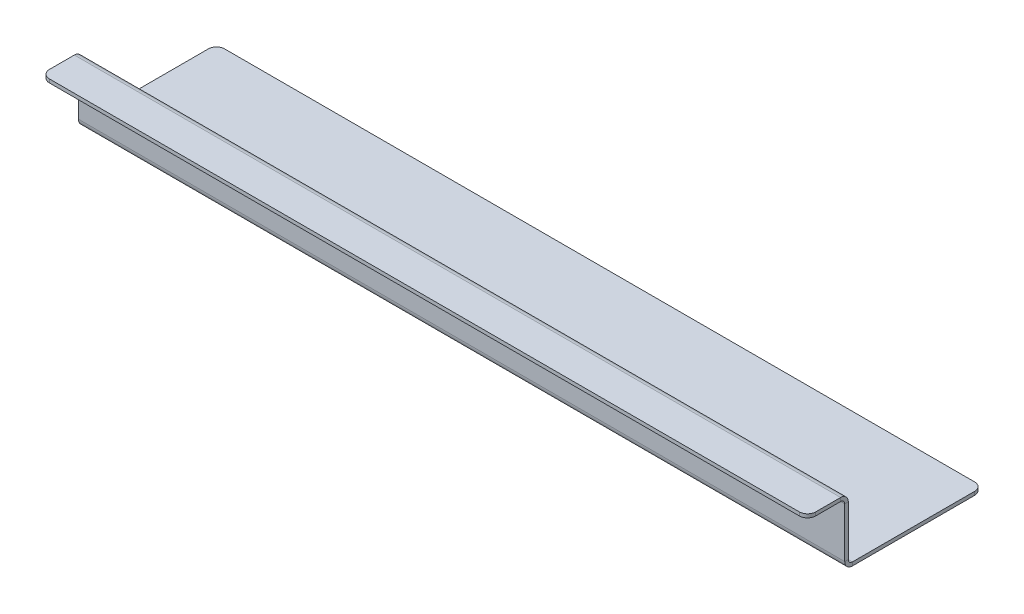
ISO-10303-21;
HEADER;
FILE_DESCRIPTION(('STEP AP214'),'2;1');
FILE_NAME('part.step','',(''),(''),'','','');
FILE_SCHEMA(('AUTOMOTIVE_DESIGN { 1 0 10303 214 1 1 1 1 }'));
ENDSEC;
DATA;
#1=APPLICATION_CONTEXT('core data for automotive mechanical design processes');
#2=APPLICATION_PROTOCOL_DEFINITION('international standard','automotive_design',2000,#1);
#3=PRODUCT_CONTEXT('',#1,'mechanical');
#4=PRODUCT('Part','Part','',(#3));
#5=PRODUCT_RELATED_PRODUCT_CATEGORY('part','',(#4));
#6=PRODUCT_DEFINITION_FORMATION('','',#4);
#7=PRODUCT_DEFINITION_CONTEXT('part definition',#1,'design');
#8=PRODUCT_DEFINITION('design','',#6,#7);
#9=PRODUCT_DEFINITION_SHAPE('','',#8);
#10=(LENGTH_UNIT() NAMED_UNIT(*) SI_UNIT(.MILLI.,.METRE.));
#11=(NAMED_UNIT(*) PLANE_ANGLE_UNIT() SI_UNIT($,.RADIAN.));
#12=(NAMED_UNIT(*) SI_UNIT($,.STERADIAN.) SOLID_ANGLE_UNIT());
#13=UNCERTAINTY_MEASURE_WITH_UNIT(LENGTH_MEASURE(1.E-05),#10,'distance_accuracy_value','');
#14=(GEOMETRIC_REPRESENTATION_CONTEXT(3) GLOBAL_UNCERTAINTY_ASSIGNED_CONTEXT((#13)) GLOBAL_UNIT_ASSIGNED_CONTEXT((#10,
#11,#12)) REPRESENTATION_CONTEXT('',''));
#15=CARTESIAN_POINT('',(0.,0.,0.));
#16=DIRECTION('',(0.,0.,1.));
#17=DIRECTION('',(1.,0.,0.));
#18=AXIS2_PLACEMENT_3D('',#15,#16,#17);
#19=CARTESIAN_POINT('',(596.9,-50.8,-31.7500000000002));
#20=DIRECTION('',(-1.,0.,0.));
#21=DIRECTION('',(0.,0.,1.));
#22=AXIS2_PLACEMENT_3D('',#19,#20,#21);
#23=PLANE('',#22);
#24=DIRECTION('',(0.,0.,1.));
#25=VECTOR('',#24,1.);
#26=CARTESIAN_POINT('',(596.9,-44.87164,-31.7500000000001));
#27=LINE('',#26,#25);
#28=CARTESIAN_POINT('',(596.9,-44.87164,-31.7500000000001));
#29=VERTEX_POINT('',#28);
#30=CARTESIAN_POINT('',(596.9,-44.87164,-28.9966400000001));
#31=VERTEX_POINT('',#30);
#32=EDGE_CURVE('E252',#29,#31,#27,.T.);
#33=ORIENTED_EDGE('',*,*,#32,.F.);
#34=DIRECTION('',(0.,-1.,0.));
#35=VECTOR('',#34,1.);
#36=CARTESIAN_POINT('',(596.9,1.19661315799875E-13,-31.75));
#37=LINE('',#36,#35);
#38=CARTESIAN_POINT('',(596.9,-5.92835999999999,-31.75));
#39=VERTEX_POINT('',#38);
#40=EDGE_CURVE('E260',#39,#29,#37,.T.);
#41=ORIENTED_EDGE('',*,*,#40,.F.);
#42=DIRECTION('',(0.,0.,1.));
#43=VECTOR('',#42,1.);
#44=CARTESIAN_POINT('',(596.9,-5.92836000000001,-28.99664));
#45=LINE('',#44,#43);
#46=CARTESIAN_POINT('',(596.9,-5.92836000000005,-28.99664));
#47=VERTEX_POINT('',#46);
#48=EDGE_CURVE('E271',#47,#39,#45,.F.);
#49=ORIENTED_EDGE('',*,*,#48,.F.);
#50=DIRECTION('',(0.,1.,0.));
#51=VECTOR('',#50,1.);
#52=CARTESIAN_POINT('',(596.9,-50.8,-28.9966400000002));
#53=LINE('',#52,#51);
#54=EDGE_CURVE('E265',#47,#31,#53,.F.);
#55=ORIENTED_EDGE('',*,*,#54,.T.);
#56=EDGE_LOOP('',(#33,#41,#49,#55));
#57=FACE_BOUND('',#56,.T.);
#58=ADVANCED_FACE('F83',(#57),#23,.F.);
#59=CARTESIAN_POINT('',(0.,-2.75335999999999,-31.75));
#60=DIRECTION('',(1.,0.,0.));
#61=DIRECTION('',(0.,0.,-1.));
#62=AXIS2_PLACEMENT_3D('',#59,#60,#61);
#63=PLANE('',#62);
#64=DIRECTION('',(0.,0.,1.));
#65=VECTOR('',#64,1.);
#66=CARTESIAN_POINT('',(0.,-44.87164,-31.7500000000001));
#67=LINE('',#66,#65);
#68=CARTESIAN_POINT('',(0.,-44.87164,-31.7500000000001));
#69=VERTEX_POINT('',#68);
#70=CARTESIAN_POINT('',(0.,-44.87164,-28.9966400000001));
#71=VERTEX_POINT('',#70);
#72=EDGE_CURVE('E245',#69,#71,#67,.T.);
#73=ORIENTED_EDGE('',*,*,#72,.T.);
#74=DIRECTION('',(0.,-1.,0.));
#75=VECTOR('',#74,1.);
#76=CARTESIAN_POINT('',(0.,-2.75336,-28.99664));
#77=LINE('',#76,#75);
#78=CARTESIAN_POINT('',(0.,-5.92835999999997,-28.99664));
#79=VERTEX_POINT('',#78);
#80=EDGE_CURVE('E263',#71,#79,#77,.F.);
#81=ORIENTED_EDGE('',*,*,#80,.T.);
#82=DIRECTION('',(0.,0.,1.));
#83=VECTOR('',#82,1.);
#84=CARTESIAN_POINT('',(0.,-5.92835999999997,-31.75));
#85=LINE('',#84,#83);
#86=CARTESIAN_POINT('',(0.,-5.92835999999996,-31.75));
#87=VERTEX_POINT('',#86);
#88=EDGE_CURVE('E255',#79,#87,#85,.F.);
#89=ORIENTED_EDGE('',*,*,#88,.T.);
#90=DIRECTION('',(0.,1.,0.));
#91=VECTOR('',#90,1.);
#92=CARTESIAN_POINT('',(0.,1.19661315799875E-13,-31.75));
#93=LINE('',#92,#91);
#94=EDGE_CURVE('E257',#69,#87,#93,.T.);
#95=ORIENTED_EDGE('',*,*,#94,.F.);
#96=EDGE_LOOP('',(#73,#81,#89,#95));
#97=FACE_BOUND('',#96,.T.);
#98=ADVANCED_FACE('F385',(#97),#63,.F.);
#99=CARTESIAN_POINT('',(0.,1.19661315799875E-13,-31.75));
#100=DIRECTION('',(0.,0.,1.));
#101=DIRECTION('',(0.,-1.,0.));
#102=AXIS2_PLACEMENT_3D('',#99,#100,#101);
#103=PLANE('',#102);
#104=DIRECTION('',(-1.,0.,0.));
#105=VECTOR('',#104,1.);
#106=CARTESIAN_POINT('',(0.,-44.87164,-31.7500000000001));
#107=LINE('',#106,#105);
#108=EDGE_CURVE('E249',#69,#29,#107,.F.);
#109=ORIENTED_EDGE('',*,*,#108,.F.);
#110=ORIENTED_EDGE('',*,*,#94,.T.);
#111=DIRECTION('',(1.,0.,0.));
#112=VECTOR('',#111,1.);
#113=CARTESIAN_POINT('',(0.,-5.92835999999997,-31.75));
#114=LINE('',#113,#112);
#115=EDGE_CURVE('E268',#39,#87,#114,.F.);
#116=ORIENTED_EDGE('',*,*,#115,.F.);
#117=ORIENTED_EDGE('',*,*,#40,.T.);
#118=EDGE_LOOP('',(#109,#110,#116,#117));
#119=FACE_BOUND('',#118,.T.);
#120=ADVANCED_FACE('F374',(#119),#103,.F.);
#121=CARTESIAN_POINT('',(0.,1.10048010740757E-13,-28.99664));
#122=DIRECTION('',(0.,0.,1.));
#123=DIRECTION('',(0.,-1.,0.));
#124=AXIS2_PLACEMENT_3D('',#121,#122,#123);
#125=PLANE('',#124);
#126=ORIENTED_EDGE('',*,*,#80,.F.);
#127=DIRECTION('',(-1.,0.,0.));
#128=VECTOR('',#127,1.);
#129=CARTESIAN_POINT('',(0.,-44.87164,-28.9966400000001));
#130=LINE('',#129,#128);
#131=EDGE_CURVE('E206',#71,#31,#130,.F.);
#132=ORIENTED_EDGE('',*,*,#131,.T.);
#133=ORIENTED_EDGE('',*,*,#54,.F.);
#134=DIRECTION('',(1.,0.,0.));
#135=VECTOR('',#134,1.);
#136=CARTESIAN_POINT('',(0.,-5.92835999999999,-28.99664));
#137=LINE('',#136,#135);
#138=EDGE_CURVE('E274',#79,#47,#137,.T.);
#139=ORIENTED_EDGE('',*,*,#138,.F.);
#140=EDGE_LOOP('',(#126,#132,#133,#139));
#141=FACE_BOUND('',#140,.T.);
#142=ADVANCED_FACE('F389',(#141),#125,.T.);
#143=CARTESIAN_POINT('',(596.9,-2.75336,0.));
#144=DIRECTION('',(1.,0.,0.));
#145=DIRECTION('',(0.,0.,-1.));
#146=AXIS2_PLACEMENT_3D('',#143,#144,#145);
#147=PLANE('',#146);
#148=DIRECTION('',(0.,0.,-1.));
#149=VECTOR('',#148,1.);
#150=CARTESIAN_POINT('',(596.9,0.,0.));
#151=LINE('',#150,#149);
#152=CARTESIAN_POINT('',(596.9,0.,-6.35));
#153=VERTEX_POINT('',#152);
#154=CARTESIAN_POINT('',(596.9,0.,-25.82164));
#155=VERTEX_POINT('',#154);
#156=EDGE_CURVE('E305',#153,#155,#151,.T.);
#157=ORIENTED_EDGE('',*,*,#156,.F.);
#158=DIRECTION('',(0.,1.,0.));
#159=VECTOR('',#158,1.);
#160=CARTESIAN_POINT('',(596.9,-2.75336,-6.35));
#161=LINE('',#160,#159);
#162=CARTESIAN_POINT('',(596.9,-2.75336,-6.35));
#163=VERTEX_POINT('',#162);
#164=EDGE_CURVE('E325',#153,#163,#161,.F.);
#165=ORIENTED_EDGE('',*,*,#164,.T.);
#166=DIRECTION('',(0.,0.,-1.));
#167=VECTOR('',#166,1.);
#168=CARTESIAN_POINT('',(596.9,-2.75336,0.));
#169=LINE('',#168,#167);
#170=CARTESIAN_POINT('',(596.9,-2.75336,-25.82164));
#171=VERTEX_POINT('',#170);
#172=EDGE_CURVE('E308',#163,#171,#169,.T.);
#173=ORIENTED_EDGE('',*,*,#172,.T.);
#174=DIRECTION('',(0.,1.,0.));
#175=VECTOR('',#174,1.);
#176=CARTESIAN_POINT('',(596.9,-2.75336000000006,-25.82164));
#177=LINE('',#176,#175);
#178=EDGE_CURVE('E284',#171,#155,#177,.T.);
#179=ORIENTED_EDGE('',*,*,#178,.T.);
#180=EDGE_LOOP('',(#157,#165,#173,#179));
#181=FACE_BOUND('',#180,.T.);
#182=ADVANCED_FACE('F398',(#181),#147,.T.);
#183=CARTESIAN_POINT('',(0.,-2.75336,0.));
#184=DIRECTION('',(0.,-1.,0.));
#185=DIRECTION('',(0.,0.,-1.));
#186=AXIS2_PLACEMENT_3D('',#183,#184,#185);
#187=PLANE('',#186);
#188=ORIENTED_EDGE('',*,*,#172,.F.);
#189=CARTESIAN_POINT('',(590.55,-2.75336,-6.35));
#190=DIRECTION('',(0.,-1.,0.));
#191=DIRECTION('',(0.,0.,-1.));
#192=AXIS2_PLACEMENT_3D('',#189,#190,#191);
#193=CIRCLE('',#192,6.35);
#194=CARTESIAN_POINT('',(590.55,-2.75336,0.));
#195=VERTEX_POINT('',#194);
#196=EDGE_CURVE('E329',#163,#195,#193,.T.);
#197=ORIENTED_EDGE('',*,*,#196,.T.);
#198=DIRECTION('',(1.,0.,0.));
#199=VECTOR('',#198,1.);
#200=CARTESIAN_POINT('',(0.,-2.75336,0.));
#201=LINE('',#200,#199);
#202=CARTESIAN_POINT('',(6.35,-2.75336,0.));
#203=VERTEX_POINT('',#202);
#204=EDGE_CURVE('E304',#203,#195,#201,.T.);
#205=ORIENTED_EDGE('',*,*,#204,.F.);
#206=CARTESIAN_POINT('',(6.35,-2.75336,-6.35));
#207=DIRECTION('',(0.,-1.,0.));
#208=DIRECTION('',(0.,0.,-1.));
#209=AXIS2_PLACEMENT_3D('',#206,#207,#208);
#210=CIRCLE('',#209,6.35);
#211=CARTESIAN_POINT('',(0.,-2.75336,-6.35));
#212=VERTEX_POINT('',#211);
#213=EDGE_CURVE('E327',#203,#212,#210,.T.);
#214=ORIENTED_EDGE('',*,*,#213,.T.);
#215=DIRECTION('',(0.,0.,1.));
#216=VECTOR('',#215,1.);
#217=CARTESIAN_POINT('',(0.,-2.75336,0.));
#218=LINE('',#217,#216);
#219=CARTESIAN_POINT('',(0.,-2.75336,-25.82164));
#220=VERTEX_POINT('',#219);
#221=EDGE_CURVE('E301',#220,#212,#218,.T.);
#222=ORIENTED_EDGE('',*,*,#221,.F.);
#223=DIRECTION('',(1.,0.,0.));
#224=VECTOR('',#223,1.);
#225=CARTESIAN_POINT('',(596.9,-2.75336000000006,-25.82164));
#226=LINE('',#225,#224);
#227=EDGE_CURVE('E290',#171,#220,#226,.F.);
#228=ORIENTED_EDGE('',*,*,#227,.F.);
#229=EDGE_LOOP('',(#188,#197,#205,#214,#222,#228));
#230=FACE_BOUND('',#229,.T.);
#231=ADVANCED_FACE('F421',(#230),#187,.T.);
#232=CARTESIAN_POINT('',(0.,0.,0.));
#233=DIRECTION('',(0.,-1.,0.));
#234=DIRECTION('',(0.,0.,-1.));
#235=AXIS2_PLACEMENT_3D('',#232,#233,#234);
#236=PLANE('',#235);
#237=DIRECTION('',(1.,0.,0.));
#238=VECTOR('',#237,1.);
#239=CARTESIAN_POINT('',(0.,0.,0.));
#240=LINE('',#239,#238);
#241=CARTESIAN_POINT('',(6.35,0.,0.));
#242=VERTEX_POINT('',#241);
#243=CARTESIAN_POINT('',(590.55,0.,0.));
#244=VERTEX_POINT('',#243);
#245=EDGE_CURVE('E313',#242,#244,#240,.T.);
#246=ORIENTED_EDGE('',*,*,#245,.T.);
#247=CARTESIAN_POINT('',(590.55,0.,-6.35));
#248=DIRECTION('',(0.,-1.,0.));
#249=DIRECTION('',(0.,0.,-1.));
#250=AXIS2_PLACEMENT_3D('',#247,#248,#249);
#251=CIRCLE('',#250,6.35);
#252=EDGE_CURVE('E323',#244,#153,#251,.F.);
#253=ORIENTED_EDGE('',*,*,#252,.T.);
#254=ORIENTED_EDGE('',*,*,#156,.T.);
#255=DIRECTION('',(1.,0.,0.));
#256=VECTOR('',#255,1.);
#257=CARTESIAN_POINT('',(596.9,0.,-25.82164));
#258=LINE('',#257,#256);
#259=CARTESIAN_POINT('',(0.,0.,-25.82164));
#260=VERTEX_POINT('',#259);
#261=EDGE_CURVE('E278',#155,#260,#258,.F.);
#262=ORIENTED_EDGE('',*,*,#261,.T.);
#263=DIRECTION('',(0.,0.,1.));
#264=VECTOR('',#263,1.);
#265=CARTESIAN_POINT('',(0.,0.,0.));
#266=LINE('',#265,#264);
#267=CARTESIAN_POINT('',(0.,0.,-6.35));
#268=VERTEX_POINT('',#267);
#269=EDGE_CURVE('E298',#260,#268,#266,.T.);
#270=ORIENTED_EDGE('',*,*,#269,.T.);
#271=CARTESIAN_POINT('',(6.35,0.,-6.35));
#272=DIRECTION('',(0.,-1.,0.));
#273=DIRECTION('',(0.,0.,-1.));
#274=AXIS2_PLACEMENT_3D('',#271,#272,#273);
#275=CIRCLE('',#274,6.35);
#276=EDGE_CURVE('E321',#268,#242,#275,.F.);
#277=ORIENTED_EDGE('',*,*,#276,.T.);
#278=EDGE_LOOP('',(#246,#253,#254,#262,#270,#277));
#279=FACE_BOUND('',#278,.T.);
#280=ADVANCED_FACE('F404',(#279),#236,.F.);
#281=CARTESIAN_POINT('',(0.,-2.75336,0.));
#282=DIRECTION('',(-1.,0.,0.));
#283=DIRECTION('',(0.,0.,1.));
#284=AXIS2_PLACEMENT_3D('',#281,#282,#283);
#285=PLANE('',#284);
#286=ORIENTED_EDGE('',*,*,#221,.T.);
#287=DIRECTION('',(0.,1.,0.));
#288=VECTOR('',#287,1.);
#289=CARTESIAN_POINT('',(0.,-2.75336,-6.35));
#290=LINE('',#289,#288);
#291=EDGE_CURVE('E13',#212,#268,#290,.T.);
#292=ORIENTED_EDGE('',*,*,#291,.T.);
#293=ORIENTED_EDGE('',*,*,#269,.F.);
#294=DIRECTION('',(0.,1.,0.));
#295=VECTOR('',#294,1.);
#296=CARTESIAN_POINT('',(0.,-2.75335999999998,-25.82164));
#297=LINE('',#296,#295);
#298=EDGE_CURVE('E295',#220,#260,#297,.T.);
#299=ORIENTED_EDGE('',*,*,#298,.F.);
#300=EDGE_LOOP('',(#286,#292,#293,#299));
#301=FACE_BOUND('',#300,.T.);
#302=ADVANCED_FACE('F406',(#301),#285,.T.);
#303=CARTESIAN_POINT('',(0.,-2.75336,0.));
#304=DIRECTION('',(0.,0.,1.));
#305=DIRECTION('',(1.,0.,0.));
#306=AXIS2_PLACEMENT_3D('',#303,#304,#305);
#307=PLANE('',#306);
#308=ORIENTED_EDGE('',*,*,#204,.T.);
#309=DIRECTION('',(0.,1.,0.));
#310=VECTOR('',#309,1.);
#311=CARTESIAN_POINT('',(590.55,-2.75336,0.));
#312=LINE('',#311,#310);
#313=EDGE_CURVE('E318',#195,#244,#312,.T.);
#314=ORIENTED_EDGE('',*,*,#313,.T.);
#315=ORIENTED_EDGE('',*,*,#245,.F.);
#316=DIRECTION('',(0.,1.,0.));
#317=VECTOR('',#316,1.);
#318=CARTESIAN_POINT('',(6.35,-2.75336,0.));
#319=LINE('',#318,#317);
#320=EDGE_CURVE('E310',#242,#203,#319,.F.);
#321=ORIENTED_EDGE('',*,*,#320,.T.);
#322=EDGE_LOOP('',(#308,#314,#315,#321));
#323=FACE_BOUND('',#322,.T.);
#324=ADVANCED_FACE('F414',(#323),#307,.T.);
#325=CARTESIAN_POINT('',(0.,-5.92835999999998,-25.82164));
#326=DIRECTION('',(-1.,0.,0.));
#327=DIRECTION('',(0.,-1.,0.));
#328=AXIS2_PLACEMENT_3D('',#325,#326,#327);
#329=PLANE('',#328);
#330=ORIENTED_EDGE('',*,*,#88,.F.);
#331=CARTESIAN_POINT('',(0.,-5.92835999999998,-25.82164));
#332=DIRECTION('',(1.,0.,0.));
#333=DIRECTION('',(0.,1.,0.));
#334=AXIS2_PLACEMENT_3D('',#331,#332,#333);
#335=CIRCLE('',#334,3.175);
#336=EDGE_CURVE('E287',#220,#79,#335,.F.);
#337=ORIENTED_EDGE('',*,*,#336,.F.);
#338=ORIENTED_EDGE('',*,*,#298,.T.);
#339=CARTESIAN_POINT('',(0.,-5.92835999999998,-25.82164));
#340=DIRECTION('',(1.,0.,0.));
#341=DIRECTION('',(0.,1.,0.));
#342=AXIS2_PLACEMENT_3D('',#339,#340,#341);
#343=CIRCLE('',#342,5.92836);
#344=EDGE_CURVE('E280',#260,#87,#343,.F.);
#345=ORIENTED_EDGE('',*,*,#344,.T.);
#346=EDGE_LOOP('',(#330,#337,#338,#345));
#347=FACE_BOUND('',#346,.T.);
#348=ADVANCED_FACE('F382',(#347),#329,.T.);
#349=CARTESIAN_POINT('',(596.9,-5.92836000000006,-25.82164));
#350=DIRECTION('',(-1.,0.,0.));
#351=DIRECTION('',(0.,-1.,0.));
#352=AXIS2_PLACEMENT_3D('',#349,#350,#351);
#353=PLANE('',#352);
#354=CARTESIAN_POINT('',(596.9,-5.92836000000006,-25.82164));
#355=DIRECTION('',(1.,0.,0.));
#356=DIRECTION('',(0.,1.,0.));
#357=AXIS2_PLACEMENT_3D('',#354,#355,#356);
#358=CIRCLE('',#357,3.175);
#359=EDGE_CURVE('E259',#47,#171,#358,.T.);
#360=ORIENTED_EDGE('',*,*,#359,.F.);
#361=ORIENTED_EDGE('',*,*,#48,.T.);
#362=CARTESIAN_POINT('',(596.9,-5.92836000000006,-25.82164));
#363=DIRECTION('',(1.,0.,0.));
#364=DIRECTION('',(0.,1.,0.));
#365=AXIS2_PLACEMENT_3D('',#362,#363,#364);
#366=CIRCLE('',#365,5.92836);
#367=EDGE_CURVE('E281',#39,#155,#366,.T.);
#368=ORIENTED_EDGE('',*,*,#367,.T.);
#369=ORIENTED_EDGE('',*,*,#178,.F.);
#370=EDGE_LOOP('',(#360,#361,#368,#369));
#371=FACE_BOUND('',#370,.T.);
#372=ADVANCED_FACE('F395',(#371),#353,.F.);
#373=CARTESIAN_POINT('',(596.9,-5.92836000000006,-25.82164));
#374=DIRECTION('',(1.,0.,0.));
#375=DIRECTION('',(0.,0.,-1.));
#376=AXIS2_PLACEMENT_3D('',#373,#374,#375);
#377=CYLINDRICAL_SURFACE('',#376,5.92836);
#378=ORIENTED_EDGE('',*,*,#261,.F.);
#379=ORIENTED_EDGE('',*,*,#367,.F.);
#380=ORIENTED_EDGE('',*,*,#115,.T.);
#381=ORIENTED_EDGE('',*,*,#344,.F.);
#382=EDGE_LOOP('',(#378,#379,#380,#381));
#383=FACE_BOUND('',#382,.T.);
#384=ADVANCED_FACE('F379',(#383),#377,.T.);
#385=CARTESIAN_POINT('',(596.9,-5.92836000000006,-25.82164));
#386=DIRECTION('',(1.,0.,0.));
#387=DIRECTION('',(0.,0.,-1.));
#388=AXIS2_PLACEMENT_3D('',#385,#386,#387);
#389=CYLINDRICAL_SURFACE('',#388,3.175);
#390=ORIENTED_EDGE('',*,*,#227,.T.);
#391=ORIENTED_EDGE('',*,*,#336,.T.);
#392=ORIENTED_EDGE('',*,*,#138,.T.);
#393=ORIENTED_EDGE('',*,*,#359,.T.);
#394=EDGE_LOOP('',(#390,#391,#392,#393));
#395=FACE_BOUND('',#394,.T.);
#396=ADVANCED_FACE('F392',(#395),#389,.F.);
#397=CARTESIAN_POINT('',(596.9,-44.87164,-34.9250000000002));
#398=DIRECTION('',(1.,0.,0.));
#399=DIRECTION('',(0.,0.,-1.));
#400=AXIS2_PLACEMENT_3D('',#397,#398,#399);
#401=PLANE('',#400);
#402=DIRECTION('',(0.,1.,0.));
#403=VECTOR('',#402,1.);
#404=CARTESIAN_POINT('',(596.9,-50.8,-34.9250000000002));
#405=LINE('',#404,#403);
#406=CARTESIAN_POINT('',(596.9,-48.04664,-34.9250000000002));
#407=VERTEX_POINT('',#406);
#408=CARTESIAN_POINT('',(596.9,-50.8,-34.9250000000002));
#409=VERTEX_POINT('',#408);
#410=EDGE_CURVE('E240',#407,#409,#405,.F.);
#411=ORIENTED_EDGE('',*,*,#410,.F.);
#412=CARTESIAN_POINT('',(596.9,-44.87164,-34.9250000000002));
#413=DIRECTION('',(-1.,0.,0.));
#414=DIRECTION('',(0.,0.,1.));
#415=AXIS2_PLACEMENT_3D('',#412,#413,#414);
#416=CIRCLE('',#415,3.175);
#417=EDGE_CURVE('E209',#29,#407,#416,.F.);
#418=ORIENTED_EDGE('',*,*,#417,.F.);
#419=ORIENTED_EDGE('',*,*,#32,.T.);
#420=CARTESIAN_POINT('',(596.9,-44.87164,-34.9250000000002));
#421=DIRECTION('',(-1.,0.,0.));
#422=DIRECTION('',(0.,0.,1.));
#423=AXIS2_PLACEMENT_3D('',#420,#421,#422);
#424=CIRCLE('',#423,5.92836);
#425=EDGE_CURVE('E244',#31,#409,#424,.F.);
#426=ORIENTED_EDGE('',*,*,#425,.T.);
#427=EDGE_LOOP('',(#411,#418,#419,#426));
#428=FACE_BOUND('',#427,.T.);
#429=ADVANCED_FACE('F367',(#428),#401,.T.);
#430=CARTESIAN_POINT('',(0.,-44.87164,-34.9250000000002));
#431=DIRECTION('',(1.,0.,0.));
#432=DIRECTION('',(0.,0.,-1.));
#433=AXIS2_PLACEMENT_3D('',#430,#431,#432);
#434=PLANE('',#433);
#435=CARTESIAN_POINT('',(0.,-44.87164,-34.9250000000002));
#436=DIRECTION('',(-1.,0.,0.));
#437=DIRECTION('',(0.,0.,1.));
#438=AXIS2_PLACEMENT_3D('',#435,#436,#437);
#439=CIRCLE('',#438,3.175);
#440=CARTESIAN_POINT('',(0.,-48.04664,-34.9250000000002));
#441=VERTEX_POINT('',#440);
#442=EDGE_CURVE('E216',#441,#69,#439,.T.);
#443=ORIENTED_EDGE('',*,*,#442,.F.);
#444=DIRECTION('',(0.,1.,0.));
#445=VECTOR('',#444,1.);
#446=CARTESIAN_POINT('',(0.,-48.04664,-34.9250000000001));
#447=LINE('',#446,#445);
#448=CARTESIAN_POINT('',(0.,-50.8,-34.9250000000001));
#449=VERTEX_POINT('',#448);
#450=EDGE_CURVE('E213',#441,#449,#447,.F.);
#451=ORIENTED_EDGE('',*,*,#450,.T.);
#452=CARTESIAN_POINT('',(0.,-44.87164,-34.9250000000002));
#453=DIRECTION('',(-1.,0.,0.));
#454=DIRECTION('',(0.,0.,1.));
#455=AXIS2_PLACEMENT_3D('',#452,#453,#454);
#456=CIRCLE('',#455,5.92836);
#457=EDGE_CURVE('E199',#449,#71,#456,.T.);
#458=ORIENTED_EDGE('',*,*,#457,.T.);
#459=ORIENTED_EDGE('',*,*,#72,.F.);
#460=EDGE_LOOP('',(#443,#451,#458,#459));
#461=FACE_BOUND('',#460,.T.);
#462=ADVANCED_FACE('F214',(#461),#434,.F.);
#463=CARTESIAN_POINT('',(0.,-44.87164,-34.9250000000002));
#464=DIRECTION('',(-1.,0.,0.));
#465=DIRECTION('',(0.,-1.,0.));
#466=AXIS2_PLACEMENT_3D('',#463,#464,#465);
#467=CYLINDRICAL_SURFACE('',#466,5.92836);
#468=ORIENTED_EDGE('',*,*,#131,.F.);
#469=ORIENTED_EDGE('',*,*,#457,.F.);
#470=DIRECTION('',(-1.,0.,0.));
#471=VECTOR('',#470,1.);
#472=CARTESIAN_POINT('',(596.9,-50.8,-34.9250000000002));
#473=LINE('',#472,#471);
#474=EDGE_CURVE('E203',#449,#409,#473,.F.);
#475=ORIENTED_EDGE('',*,*,#474,.T.);
#476=ORIENTED_EDGE('',*,*,#425,.F.);
#477=EDGE_LOOP('',(#468,#469,#475,#476));
#478=FACE_BOUND('',#477,.T.);
#479=ADVANCED_FACE('F201',(#478),#467,.T.);
#480=CARTESIAN_POINT('',(0.,-44.87164,-34.9250000000002));
#481=DIRECTION('',(-1.,0.,0.));
#482=DIRECTION('',(0.,-1.,0.));
#483=AXIS2_PLACEMENT_3D('',#480,#481,#482);
#484=CYLINDRICAL_SURFACE('',#483,3.175);
#485=ORIENTED_EDGE('',*,*,#108,.T.);
#486=ORIENTED_EDGE('',*,*,#417,.T.);
#487=DIRECTION('',(-1.,0.,0.));
#488=VECTOR('',#487,1.);
#489=CARTESIAN_POINT('',(596.9,-48.04664,-34.9250000000002));
#490=LINE('',#489,#488);
#491=EDGE_CURVE('E218',#407,#441,#490,.T.);
#492=ORIENTED_EDGE('',*,*,#491,.T.);
#493=ORIENTED_EDGE('',*,*,#442,.T.);
#494=EDGE_LOOP('',(#485,#486,#492,#493));
#495=FACE_BOUND('',#494,.T.);
#496=ADVANCED_FACE('F362',(#495),#484,.F.);
#497=CARTESIAN_POINT('',(596.9,-50.8,-31.7500000000002));
#498=DIRECTION('',(-1.,0.,0.));
#499=DIRECTION('',(0.,0.,1.));
#500=AXIS2_PLACEMENT_3D('',#497,#498,#499);
#501=PLANE('',#500);
#502=DIRECTION('',(0.,0.,1.));
#503=VECTOR('',#502,1.);
#504=CARTESIAN_POINT('',(596.9,-50.8,0.));
#505=LINE('',#504,#503);
#506=CARTESIAN_POINT('',(596.9,-50.8,-130.175));
#507=VERTEX_POINT('',#506);
#508=EDGE_CURVE('E225',#507,#409,#505,.T.);
#509=ORIENTED_EDGE('',*,*,#508,.F.);
#510=DIRECTION('',(0.,1.,0.));
#511=VECTOR('',#510,1.);
#512=CARTESIAN_POINT('',(596.9,-50.8,-130.175));
#513=LINE('',#512,#511);
#514=CARTESIAN_POINT('',(596.9,-48.04664,-130.175));
#515=VERTEX_POINT('',#514);
#516=EDGE_CURVE('E331',#507,#515,#513,.T.);
#517=ORIENTED_EDGE('',*,*,#516,.T.);
#518=DIRECTION('',(0.,0.,-1.));
#519=VECTOR('',#518,1.);
#520=CARTESIAN_POINT('',(596.9,-48.04664,-31.7500000000002));
#521=LINE('',#520,#519);
#522=EDGE_CURVE('E226',#515,#407,#521,.F.);
#523=ORIENTED_EDGE('',*,*,#522,.T.);
#524=ORIENTED_EDGE('',*,*,#410,.T.);
#525=EDGE_LOOP('',(#509,#517,#523,#524));
#526=FACE_BOUND('',#525,.T.);
#527=ADVANCED_FACE('F349',(#526),#501,.F.);
#528=CARTESIAN_POINT('',(0.,-50.8,-136.525));
#529=DIRECTION('',(1.,0.,0.));
#530=DIRECTION('',(0.,0.,-1.));
#531=AXIS2_PLACEMENT_3D('',#528,#529,#530);
#532=PLANE('',#531);
#533=DIRECTION('',(0.,0.,1.));
#534=VECTOR('',#533,1.);
#535=CARTESIAN_POINT('',(0.,-48.04664,-136.525));
#536=LINE('',#535,#534);
#537=CARTESIAN_POINT('',(0.,-48.04664,-130.175));
#538=VERTEX_POINT('',#537);
#539=EDGE_CURVE('E236',#441,#538,#536,.F.);
#540=ORIENTED_EDGE('',*,*,#539,.T.);
#541=DIRECTION('',(0.,1.,0.));
#542=VECTOR('',#541,1.);
#543=CARTESIAN_POINT('',(0.,-50.8,-130.175));
#544=LINE('',#543,#542);
#545=CARTESIAN_POINT('',(0.,-50.8,-130.175));
#546=VERTEX_POINT('',#545);
#547=EDGE_CURVE('E91',#538,#546,#544,.F.);
#548=ORIENTED_EDGE('',*,*,#547,.T.);
#549=DIRECTION('',(0.,0.,-1.));
#550=VECTOR('',#549,1.);
#551=CARTESIAN_POINT('',(0.,-50.8,0.));
#552=LINE('',#551,#550);
#553=EDGE_CURVE('E222',#449,#546,#552,.T.);
#554=ORIENTED_EDGE('',*,*,#553,.F.);
#555=ORIENTED_EDGE('',*,*,#450,.F.);
#556=EDGE_LOOP('',(#540,#548,#554,#555));
#557=FACE_BOUND('',#556,.T.);
#558=ADVANCED_FACE('F228',(#557),#532,.F.);
#559=CARTESIAN_POINT('',(0.,-50.8,0.));
#560=DIRECTION('',(0.,1.,0.));
#561=DIRECTION('',(0.,0.,1.));
#562=AXIS2_PLACEMENT_3D('',#559,#560,#561);
#563=PLANE('',#562);
#564=DIRECTION('',(1.,0.,0.));
#565=VECTOR('',#564,1.);
#566=CARTESIAN_POINT('',(0.,-50.8,-136.525));
#567=LINE('',#566,#565);
#568=CARTESIAN_POINT('',(6.34999999999997,-50.8,-136.525));
#569=VERTEX_POINT('',#568);
#570=CARTESIAN_POINT('',(590.55,-50.8,-136.525));
#571=VERTEX_POINT('',#570);
#572=EDGE_CURVE('E229',#569,#571,#567,.T.);
#573=ORIENTED_EDGE('',*,*,#572,.T.);
#574=CARTESIAN_POINT('',(590.55,-50.8,-130.175));
#575=DIRECTION('',(0.,1.,0.));
#576=DIRECTION('',(0.,0.,1.));
#577=AXIS2_PLACEMENT_3D('',#574,#575,#576);
#578=CIRCLE('',#577,6.35);
#579=EDGE_CURVE('E344',#571,#507,#578,.F.);
#580=ORIENTED_EDGE('',*,*,#579,.T.);
#581=ORIENTED_EDGE('',*,*,#508,.T.);
#582=ORIENTED_EDGE('',*,*,#474,.F.);
#583=ORIENTED_EDGE('',*,*,#553,.T.);
#584=CARTESIAN_POINT('',(6.34999999999997,-50.8,-130.175));
#585=DIRECTION('',(0.,1.,0.));
#586=DIRECTION('',(0.,0.,1.));
#587=AXIS2_PLACEMENT_3D('',#584,#585,#586);
#588=CIRCLE('',#587,6.35);
#589=EDGE_CURVE('E342',#546,#569,#588,.F.);
#590=ORIENTED_EDGE('',*,*,#589,.T.);
#591=EDGE_LOOP('',(#573,#580,#581,#582,#583,#590));
#592=FACE_BOUND('',#591,.T.);
#593=ADVANCED_FACE('F221',(#592),#563,.F.);
#594=CARTESIAN_POINT('',(0.,-48.04664,0.));
#595=DIRECTION('',(0.,1.,0.));
#596=DIRECTION('',(0.,0.,1.));
#597=AXIS2_PLACEMENT_3D('',#594,#595,#596);
#598=PLANE('',#597);
#599=ORIENTED_EDGE('',*,*,#522,.F.);
#600=CARTESIAN_POINT('',(590.55,-48.04664,-130.175));
#601=DIRECTION('',(0.,1.,0.));
#602=DIRECTION('',(0.,0.,1.));
#603=AXIS2_PLACEMENT_3D('',#600,#601,#602);
#604=CIRCLE('',#603,6.35);
#605=CARTESIAN_POINT('',(590.55,-48.04664,-136.525));
#606=VERTEX_POINT('',#605);
#607=EDGE_CURVE('E336',#515,#606,#604,.T.);
#608=ORIENTED_EDGE('',*,*,#607,.T.);
#609=DIRECTION('',(-1.,0.,0.));
#610=VECTOR('',#609,1.);
#611=CARTESIAN_POINT('',(596.9,-48.04664,-136.525));
#612=LINE('',#611,#610);
#613=CARTESIAN_POINT('',(6.34999999999997,-48.04664,-136.525));
#614=VERTEX_POINT('',#613);
#615=EDGE_CURVE('E232',#614,#606,#612,.F.);
#616=ORIENTED_EDGE('',*,*,#615,.F.);
#617=CARTESIAN_POINT('',(6.34999999999997,-48.04664,-130.175));
#618=DIRECTION('',(0.,1.,0.));
#619=DIRECTION('',(0.,0.,1.));
#620=AXIS2_PLACEMENT_3D('',#617,#618,#619);
#621=CIRCLE('',#620,6.35);
#622=EDGE_CURVE('E334',#614,#538,#621,.T.);
#623=ORIENTED_EDGE('',*,*,#622,.T.);
#624=ORIENTED_EDGE('',*,*,#539,.F.);
#625=ORIENTED_EDGE('',*,*,#491,.F.);
#626=EDGE_LOOP('',(#599,#608,#616,#623,#624,#625));
#627=FACE_BOUND('',#626,.T.);
#628=ADVANCED_FACE('F355',(#627),#598,.T.);
#629=CARTESIAN_POINT('',(596.9,-50.8,-136.525));
#630=DIRECTION('',(0.,0.,1.));
#631=DIRECTION('',(0.,-1.,0.));
#632=AXIS2_PLACEMENT_3D('',#629,#630,#631);
#633=PLANE('',#632);
#634=ORIENTED_EDGE('',*,*,#615,.T.);
#635=DIRECTION('',(0.,1.,0.));
#636=VECTOR('',#635,1.);
#637=CARTESIAN_POINT('',(590.55,-50.8,-136.525));
#638=LINE('',#637,#636);
#639=EDGE_CURVE('E105',#606,#571,#638,.F.);
#640=ORIENTED_EDGE('',*,*,#639,.T.);
#641=ORIENTED_EDGE('',*,*,#572,.F.);
#642=DIRECTION('',(0.,1.,0.));
#643=VECTOR('',#642,1.);
#644=CARTESIAN_POINT('',(6.34999999999997,-50.8,-136.525));
#645=LINE('',#644,#643);
#646=EDGE_CURVE('E338',#569,#614,#645,.T.);
#647=ORIENTED_EDGE('',*,*,#646,.T.);
#648=EDGE_LOOP('',(#634,#640,#641,#647));
#649=FACE_BOUND('',#648,.T.);
#650=ADVANCED_FACE('F357',(#649),#633,.F.);
#651=CARTESIAN_POINT('',(590.55,-2.75336,-6.35));
#652=DIRECTION('',(0.,1.,0.));
#653=DIRECTION('',(0.,0.,1.));
#654=AXIS2_PLACEMENT_3D('',#651,#652,#653);
#655=CYLINDRICAL_SURFACE('',#654,6.35);
#656=ORIENTED_EDGE('',*,*,#196,.F.);
#657=ORIENTED_EDGE('',*,*,#164,.F.);
#658=ORIENTED_EDGE('',*,*,#252,.F.);
#659=ORIENTED_EDGE('',*,*,#313,.F.);
#660=EDGE_LOOP('',(#656,#657,#658,#659));
#661=FACE_BOUND('',#660,.T.);
#662=ADVANCED_FACE('F419',(#661),#655,.T.);
#663=CARTESIAN_POINT('',(590.55,-50.8,-130.175));
#664=DIRECTION('',(0.,1.,0.));
#665=DIRECTION('',(0.,0.,1.));
#666=AXIS2_PLACEMENT_3D('',#663,#664,#665);
#667=CYLINDRICAL_SURFACE('',#666,6.35);
#668=ORIENTED_EDGE('',*,*,#579,.F.);
#669=ORIENTED_EDGE('',*,*,#639,.F.);
#670=ORIENTED_EDGE('',*,*,#607,.F.);
#671=ORIENTED_EDGE('',*,*,#516,.F.);
#672=EDGE_LOOP('',(#668,#669,#670,#671));
#673=FACE_BOUND('',#672,.T.);
#674=ADVANCED_FACE('F352',(#673),#667,.T.);
#675=CARTESIAN_POINT('',(6.34999999999997,-50.8,-130.175));
#676=DIRECTION('',(0.,1.,0.));
#677=DIRECTION('',(0.,0.,1.));
#678=AXIS2_PLACEMENT_3D('',#675,#676,#677);
#679=CYLINDRICAL_SURFACE('',#678,6.35);
#680=ORIENTED_EDGE('',*,*,#589,.F.);
#681=ORIENTED_EDGE('',*,*,#547,.F.);
#682=ORIENTED_EDGE('',*,*,#622,.F.);
#683=ORIENTED_EDGE('',*,*,#646,.F.);
#684=EDGE_LOOP('',(#680,#681,#682,#683));
#685=FACE_BOUND('',#684,.T.);
#686=ADVANCED_FACE('F360',(#685),#679,.T.);
#687=CARTESIAN_POINT('',(6.35,-2.75336,-6.35));
#688=DIRECTION('',(0.,1.,0.));
#689=DIRECTION('',(0.,0.,1.));
#690=AXIS2_PLACEMENT_3D('',#687,#688,#689);
#691=CYLINDRICAL_SURFACE('',#690,6.35);
#692=ORIENTED_EDGE('',*,*,#213,.F.);
#693=ORIENTED_EDGE('',*,*,#320,.F.);
#694=ORIENTED_EDGE('',*,*,#276,.F.);
#695=ORIENTED_EDGE('',*,*,#291,.F.);
#696=EDGE_LOOP('',(#692,#693,#694,#695));
#697=FACE_BOUND('',#696,.T.);
#698=ADVANCED_FACE('F85',(#697),#691,.T.);
#699=CLOSED_SHELL('',(#58,#98,#120,#142,#182,#231,#280,#302,#324,#348,#372,#384,#396,#429,#462,
#479,#496,#527,#558,#593,#628,#650,#662,#674,#686,#698));
#700=MANIFOLD_SOLID_BREP('B2',#699);
#701=ADVANCED_BREP_SHAPE_REPRESENTATION('',(#18,#700),#14);
#702=SHAPE_DEFINITION_REPRESENTATION(#9,#701);
ENDSEC;
END-ISO-10303-21;
